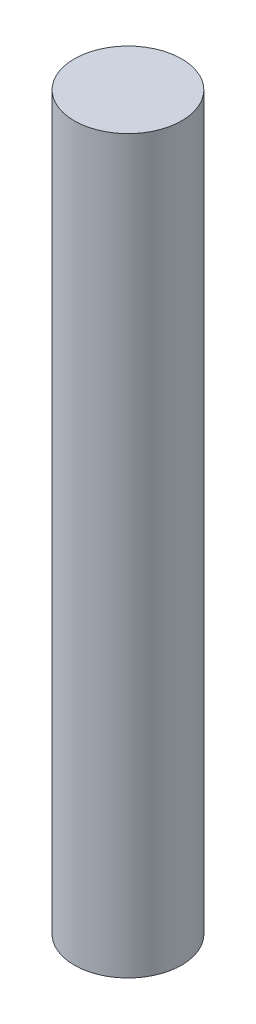
ISO-10303-21;
HEADER;
FILE_DESCRIPTION(('STEP AP214'),'2;1');
FILE_NAME('part.step','',(''),(''),'','','');
FILE_SCHEMA(('AUTOMOTIVE_DESIGN { 1 0 10303 214 1 1 1 1 }'));
ENDSEC;
DATA;
#1=APPLICATION_CONTEXT('core data for automotive mechanical design processes');
#2=APPLICATION_PROTOCOL_DEFINITION('international standard','automotive_design',2000,#1);
#3=PRODUCT_CONTEXT('',#1,'mechanical');
#4=PRODUCT('Part','Part','',(#3));
#5=PRODUCT_RELATED_PRODUCT_CATEGORY('part','',(#4));
#6=PRODUCT_DEFINITION_FORMATION('','',#4);
#7=PRODUCT_DEFINITION_CONTEXT('part definition',#1,'design');
#8=PRODUCT_DEFINITION('design','',#6,#7);
#9=PRODUCT_DEFINITION_SHAPE('','',#8);
#10=(LENGTH_UNIT() NAMED_UNIT(*) SI_UNIT(.MILLI.,.METRE.));
#11=(NAMED_UNIT(*) PLANE_ANGLE_UNIT() SI_UNIT($,.RADIAN.));
#12=(NAMED_UNIT(*) SI_UNIT($,.STERADIAN.) SOLID_ANGLE_UNIT());
#13=UNCERTAINTY_MEASURE_WITH_UNIT(LENGTH_MEASURE(1.E-05),#10,'distance_accuracy_value','');
#14=(GEOMETRIC_REPRESENTATION_CONTEXT(3) GLOBAL_UNCERTAINTY_ASSIGNED_CONTEXT((#13)) GLOBAL_UNIT_ASSIGNED_CONTEXT((#10,
#11,#12)) REPRESENTATION_CONTEXT('',''));
#15=CARTESIAN_POINT('',(0.,0.,0.));
#16=DIRECTION('',(0.,0.,1.));
#17=DIRECTION('',(1.,0.,0.));
#18=AXIS2_PLACEMENT_3D('',#15,#16,#17);
#19=CARTESIAN_POINT('',(0.,17.2974,0.));
#20=DIRECTION('',(0.,-1.,0.));
#21=DIRECTION('',(0.,0.,-1.));
#22=AXIS2_PLACEMENT_3D('',#19,#20,#21);
#23=CYLINDRICAL_SURFACE('',#22,1.27);
#24=CARTESIAN_POINT('',(0.,17.2974,0.));
#25=DIRECTION('',(0.,1.,0.));
#26=DIRECTION('',(0.,0.,1.));
#27=AXIS2_PLACEMENT_3D('',#24,#25,#26);
#28=CIRCLE('',#27,1.27);
#29=CARTESIAN_POINT('',(0.,17.2974,1.27));
#30=VERTEX_POINT('',#29);
#31=EDGE_CURVE('E10',#30,#30,#28,.T.);
#32=ORIENTED_EDGE('',*,*,#31,.F.);
#33=EDGE_LOOP('',(#32));
#34=FACE_BOUND('',#33,.T.);
#35=CARTESIAN_POINT('',(0.,0.,0.));
#36=DIRECTION('',(0.,1.,0.));
#37=DIRECTION('',(0.,0.,1.));
#38=AXIS2_PLACEMENT_3D('',#35,#36,#37);
#39=CIRCLE('',#38,1.27);
#40=CARTESIAN_POINT('',(0.,0.,1.27));
#41=VERTEX_POINT('',#40);
#42=EDGE_CURVE('E35',#41,#41,#39,.T.);
#43=ORIENTED_EDGE('',*,*,#42,.T.);
#44=EDGE_LOOP('',(#43));
#45=FACE_BOUND('',#44,.T.);
#46=ADVANCED_FACE('F32',(#34,#45),#23,.T.);
#47=CARTESIAN_POINT('',(0.,17.2974,0.));
#48=DIRECTION('',(0.,1.,0.));
#49=DIRECTION('',(0.,0.,1.));
#50=AXIS2_PLACEMENT_3D('',#47,#48,#49);
#51=PLANE('',#50);
#52=ORIENTED_EDGE('',*,*,#31,.T.);
#53=EDGE_LOOP('',(#52));
#54=FACE_BOUND('',#53,.T.);
#55=ADVANCED_FACE('F47',(#54),#51,.T.);
#56=CARTESIAN_POINT('',(0.,0.,0.));
#57=DIRECTION('',(0.,1.,0.));
#58=DIRECTION('',(0.,0.,1.));
#59=AXIS2_PLACEMENT_3D('',#56,#57,#58);
#60=PLANE('',#59);
#61=ORIENTED_EDGE('',*,*,#42,.F.);
#62=EDGE_LOOP('',(#61));
#63=FACE_BOUND('',#62,.T.);
#64=ADVANCED_FACE('F45',(#63),#60,.F.);
#65=CLOSED_SHELL('',(#46,#55,#64));
#66=MANIFOLD_SOLID_BREP('B2',#65);
#67=ADVANCED_BREP_SHAPE_REPRESENTATION('',(#18,#66),#14);
#68=SHAPE_DEFINITION_REPRESENTATION(#9,#67);
ENDSEC;
END-ISO-10303-21;
